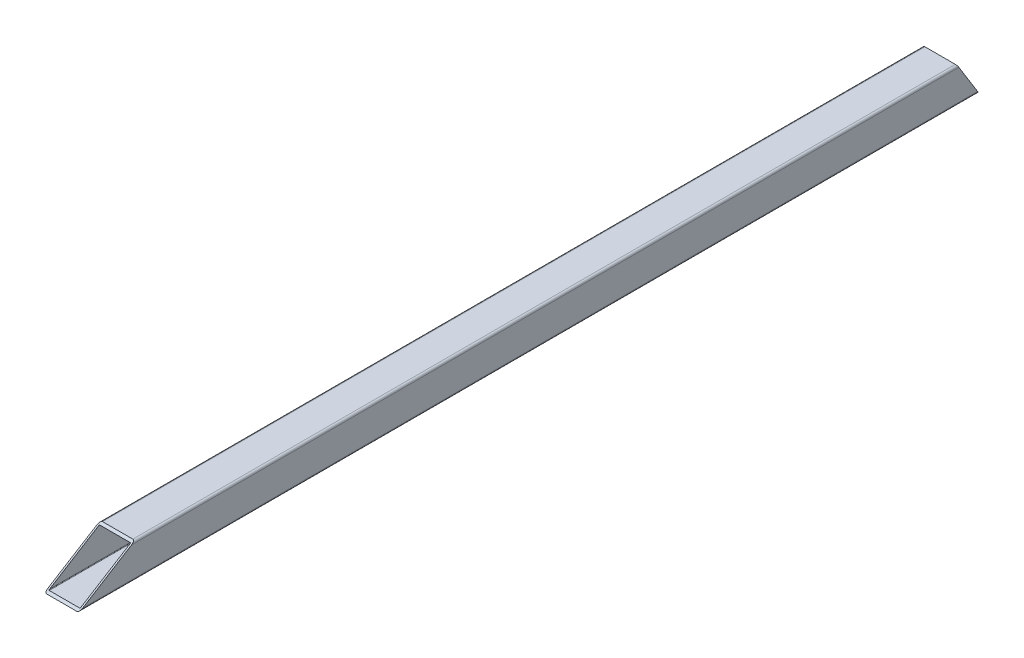
ISO-10303-21;
HEADER;
FILE_DESCRIPTION(('STEP AP214'),'2;1');
FILE_NAME('part.step','',(''),(''),'','','');
FILE_SCHEMA(('AUTOMOTIVE_DESIGN { 1 0 10303 214 1 1 1 1 }'));
ENDSEC;
DATA;
#1=APPLICATION_CONTEXT('core data for automotive mechanical design processes');
#2=APPLICATION_PROTOCOL_DEFINITION('international standard','automotive_design',2000,#1);
#3=PRODUCT_CONTEXT('',#1,'mechanical');
#4=PRODUCT('Part','Part','',(#3));
#5=PRODUCT_RELATED_PRODUCT_CATEGORY('part','',(#4));
#6=PRODUCT_DEFINITION_FORMATION('','',#4);
#7=PRODUCT_DEFINITION_CONTEXT('part definition',#1,'design');
#8=PRODUCT_DEFINITION('design','',#6,#7);
#9=PRODUCT_DEFINITION_SHAPE('','',#8);
#10=(LENGTH_UNIT() NAMED_UNIT(*) SI_UNIT(.MILLI.,.METRE.));
#11=(NAMED_UNIT(*) PLANE_ANGLE_UNIT() SI_UNIT($,.RADIAN.));
#12=(NAMED_UNIT(*) SI_UNIT($,.STERADIAN.) SOLID_ANGLE_UNIT());
#13=UNCERTAINTY_MEASURE_WITH_UNIT(LENGTH_MEASURE(1.E-05),#10,'distance_accuracy_value','');
#14=(GEOMETRIC_REPRESENTATION_CONTEXT(3) GLOBAL_UNCERTAINTY_ASSIGNED_CONTEXT((#13)) GLOBAL_UNIT_ASSIGNED_CONTEXT((#10,
#11,#12)) REPRESENTATION_CONTEXT('',''));
#15=CARTESIAN_POINT('',(0.,0.,0.));
#16=DIRECTION('',(0.,0.,1.));
#17=DIRECTION('',(1.,0.,0.));
#18=AXIS2_PLACEMENT_3D('',#15,#16,#17);
#19=CARTESIAN_POINT('',(14.,-14.,-415.2));
#20=DIRECTION('',(0.,0.,1.));
#21=DIRECTION('',(1.,0.,0.));
#22=AXIS2_PLACEMENT_3D('',#19,#20,#21);
#23=CYLINDRICAL_SURFACE('',#22,2.);
#24=CARTESIAN_POINT('',(14.,-14.,-413.959464151528));
#25=DIRECTION('',(0.,-0.527104121727736,0.849800708906289));
#26=DIRECTION('',(0.,0.849800708906289,0.527104121727736));
#27=AXIS2_PLACEMENT_3D('',#24,#25,#26);
#28=ELLIPSE('',#27,2.35349297669337,2.);
#29=CARTESIAN_POINT('',(16.,-14.,-413.959464151528));
#30=VERTEX_POINT('',#29);
#31=CARTESIAN_POINT('',(14.,-16.,-415.2));
#32=VERTEX_POINT('',#31);
#33=EDGE_CURVE('E246',#30,#32,#28,.F.);
#34=ORIENTED_EDGE('',*,*,#33,.F.);
#35=DIRECTION('',(0.,0.,1.));
#36=VECTOR('',#35,1.);
#37=CARTESIAN_POINT('',(16.,-14.,-415.2));
#38=LINE('',#37,#36);
#39=CARTESIAN_POINT('',(16.,-14.,411.975586932916));
#40=VERTEX_POINT('',#39);
#41=EDGE_CURVE('E166',#30,#40,#38,.T.);
#42=ORIENTED_EDGE('',*,*,#41,.T.);
#43=CARTESIAN_POINT('',(14.,-14.,411.975586932916));
#44=DIRECTION('',(0.,-0.849800708906287,-0.527104121727739));
#45=DIRECTION('',(0.,-0.527104121727739,0.849800708906287));
#46=AXIS2_PLACEMENT_3D('',#43,#44,#45);
#47=ELLIPSE('',#46,3.79431675366986,2.);
#48=CARTESIAN_POINT('',(14.,-16.,415.2));
#49=VERTEX_POINT('',#48);
#50=EDGE_CURVE('E208',#49,#40,#47,.F.);
#51=ORIENTED_EDGE('',*,*,#50,.F.);
#52=DIRECTION('',(0.,0.,1.));
#53=VECTOR('',#52,1.);
#54=CARTESIAN_POINT('',(14.,-16.,-415.2));
#55=LINE('',#54,#53);
#56=EDGE_CURVE('E43',#32,#49,#55,.T.);
#57=ORIENTED_EDGE('',*,*,#56,.F.);
#58=EDGE_LOOP('',(#34,#42,#51,#57));
#59=FACE_BOUND('',#58,.T.);
#60=ADVANCED_FACE('F36',(#59),#23,.T.);
#61=CARTESIAN_POINT('',(-14.,-16.,-415.2));
#62=DIRECTION('',(0.,-1.,0.));
#63=DIRECTION('',(0.,0.,-1.));
#64=AXIS2_PLACEMENT_3D('',#61,#62,#63);
#65=PLANE('',#64);
#66=ORIENTED_EDGE('',*,*,#56,.T.);
#67=DIRECTION('',(1.,0.,0.));
#68=VECTOR('',#67,1.);
#69=CARTESIAN_POINT('',(-14.,-16.,415.2));
#70=LINE('',#69,#68);
#71=CARTESIAN_POINT('',(-14.,-16.,415.2));
#72=VERTEX_POINT('',#71);
#73=EDGE_CURVE('E194',#72,#49,#70,.T.);
#74=ORIENTED_EDGE('',*,*,#73,.F.);
#75=DIRECTION('',(0.,0.,1.));
#76=VECTOR('',#75,1.);
#77=CARTESIAN_POINT('',(-14.,-16.,-415.2));
#78=LINE('',#77,#76);
#79=CARTESIAN_POINT('',(-14.,-16.,-415.2));
#80=VERTEX_POINT('',#79);
#81=EDGE_CURVE('E184',#80,#72,#78,.T.);
#82=ORIENTED_EDGE('',*,*,#81,.F.);
#83=DIRECTION('',(1.,0.,0.));
#84=VECTOR('',#83,1.);
#85=CARTESIAN_POINT('',(-14.,-16.,-415.2));
#86=LINE('',#85,#84);
#87=EDGE_CURVE('E177',#80,#32,#86,.T.);
#88=ORIENTED_EDGE('',*,*,#87,.T.);
#89=EDGE_LOOP('',(#66,#74,#82,#88));
#90=FACE_BOUND('',#89,.T.);
#91=ADVANCED_FACE('F299',(#90),#65,.T.);
#92=CARTESIAN_POINT('',(-14.,-14.,-415.2));
#93=DIRECTION('',(0.,0.,1.));
#94=DIRECTION('',(1.,0.,0.));
#95=AXIS2_PLACEMENT_3D('',#92,#93,#94);
#96=CYLINDRICAL_SURFACE('',#95,2.);
#97=CARTESIAN_POINT('',(-14.,-14.,-413.959464151528));
#98=DIRECTION('',(0.,-0.527104121727736,0.849800708906289));
#99=DIRECTION('',(0.,0.849800708906289,0.527104121727736));
#100=AXIS2_PLACEMENT_3D('',#97,#98,#99);
#101=ELLIPSE('',#100,2.35349297669337,2.);
#102=CARTESIAN_POINT('',(-16.,-14.,-413.959464151528));
#103=VERTEX_POINT('',#102);
#104=EDGE_CURVE('E250',#80,#103,#101,.F.);
#105=ORIENTED_EDGE('',*,*,#104,.F.);
#106=ORIENTED_EDGE('',*,*,#81,.T.);
#107=CARTESIAN_POINT('',(-14.,-14.,411.975586932916));
#108=DIRECTION('',(0.,-0.849800708906287,-0.527104121727739));
#109=DIRECTION('',(0.,-0.527104121727739,0.849800708906287));
#110=AXIS2_PLACEMENT_3D('',#107,#108,#109);
#111=ELLIPSE('',#110,3.79431675366986,2.);
#112=CARTESIAN_POINT('',(-16.,-14.,411.975586932916));
#113=VERTEX_POINT('',#112);
#114=EDGE_CURVE('E211',#113,#72,#111,.F.);
#115=ORIENTED_EDGE('',*,*,#114,.F.);
#116=DIRECTION('',(0.,0.,1.));
#117=VECTOR('',#116,1.);
#118=CARTESIAN_POINT('',(-16.,-14.,-415.2));
#119=LINE('',#118,#117);
#120=EDGE_CURVE('E182',#103,#113,#119,.T.);
#121=ORIENTED_EDGE('',*,*,#120,.F.);
#122=EDGE_LOOP('',(#105,#106,#115,#121));
#123=FACE_BOUND('',#122,.T.);
#124=ADVANCED_FACE('F282',(#123),#96,.T.);
#125=CARTESIAN_POINT('',(-16.,-14.,-415.2));
#126=DIRECTION('',(-1.,0.,0.));
#127=DIRECTION('',(0.,0.,1.));
#128=AXIS2_PLACEMENT_3D('',#125,#126,#127);
#129=PLANE('',#128);
#130=DIRECTION('',(0.,-0.849800708906289,-0.527104121727736));
#131=VECTOR('',#130,1.);
#132=CARTESIAN_POINT('',(-16.,-16.,-415.2));
#133=LINE('',#132,#131);
#134=CARTESIAN_POINT('',(-16.,14.,-396.591962272915));
#135=VERTEX_POINT('',#134);
#136=EDGE_CURVE('E167',#135,#103,#133,.T.);
#137=ORIENTED_EDGE('',*,*,#136,.T.);
#138=ORIENTED_EDGE('',*,*,#120,.T.);
#139=DIRECTION('',(0.,0.527104121727739,-0.849800708906287));
#140=VECTOR('',#139,1.);
#141=CARTESIAN_POINT('',(-16.,-16.,415.2));
#142=LINE('',#141,#140);
#143=CARTESIAN_POINT('',(-16.,14.0000000000001,366.833803993745));
#144=VERTEX_POINT('',#143);
#145=EDGE_CURVE('E243',#113,#144,#142,.T.);
#146=ORIENTED_EDGE('',*,*,#145,.T.);
#147=DIRECTION('',(0.,0.,1.));
#148=VECTOR('',#147,1.);
#149=CARTESIAN_POINT('',(-16.,14.,-415.2));
#150=LINE('',#149,#148);
#151=EDGE_CURVE('E180',#135,#144,#150,.T.);
#152=ORIENTED_EDGE('',*,*,#151,.F.);
#153=EDGE_LOOP('',(#137,#138,#146,#152));
#154=FACE_BOUND('',#153,.T.);
#155=ADVANCED_FACE('F276',(#154),#129,.T.);
#156=CARTESIAN_POINT('',(-14.,14.,-415.2));
#157=DIRECTION('',(0.,0.,1.));
#158=DIRECTION('',(1.,0.,0.));
#159=AXIS2_PLACEMENT_3D('',#156,#157,#158);
#160=CYLINDRICAL_SURFACE('',#159,2.);
#161=CARTESIAN_POINT('',(-14.,14.,-396.591962272915));
#162=DIRECTION('',(0.,-0.527104121727736,0.849800708906289));
#163=DIRECTION('',(0.,0.849800708906289,0.527104121727736));
#164=AXIS2_PLACEMENT_3D('',#161,#162,#163);
#165=ELLIPSE('',#164,2.35349297669337,2.);
#166=CARTESIAN_POINT('',(-14.,16.,-395.351426424442));
#167=VERTEX_POINT('',#166);
#168=EDGE_CURVE('E158',#135,#167,#165,.F.);
#169=ORIENTED_EDGE('',*,*,#168,.F.);
#170=ORIENTED_EDGE('',*,*,#151,.T.);
#171=CARTESIAN_POINT('',(-14.,14.,366.833803993745));
#172=DIRECTION('',(0.,-0.849800708906287,-0.527104121727739));
#173=DIRECTION('',(0.,-0.527104121727739,0.849800708906287));
#174=AXIS2_PLACEMENT_3D('',#171,#172,#173);
#175=ELLIPSE('',#174,3.79431675366986,2.);
#176=CARTESIAN_POINT('',(-14.,16.,363.609390926662));
#177=VERTEX_POINT('',#176);
#178=EDGE_CURVE('E213',#177,#144,#175,.F.);
#179=ORIENTED_EDGE('',*,*,#178,.F.);
#180=DIRECTION('',(0.,0.,1.));
#181=VECTOR('',#180,1.);
#182=CARTESIAN_POINT('',(-14.,16.,-415.2));
#183=LINE('',#182,#181);
#184=EDGE_CURVE('E175',#167,#177,#183,.T.);
#185=ORIENTED_EDGE('',*,*,#184,.F.);
#186=EDGE_LOOP('',(#169,#170,#179,#185));
#187=FACE_BOUND('',#186,.T.);
#188=ADVANCED_FACE('F293',(#187),#160,.T.);
#189=CARTESIAN_POINT('',(-14.,16.,-415.2));
#190=DIRECTION('',(0.,1.,0.));
#191=DIRECTION('',(0.,0.,1.));
#192=AXIS2_PLACEMENT_3D('',#189,#190,#191);
#193=PLANE('',#192);
#194=DIRECTION('',(1.,0.,0.));
#195=VECTOR('',#194,1.);
#196=CARTESIAN_POINT('',(-16.,16.,-395.351426424442));
#197=LINE('',#196,#195);
#198=CARTESIAN_POINT('',(14.,16.,-395.351426424442));
#199=VERTEX_POINT('',#198);
#200=EDGE_CURVE('E154',#167,#199,#197,.T.);
#201=ORIENTED_EDGE('',*,*,#200,.F.);
#202=ORIENTED_EDGE('',*,*,#184,.T.);
#203=DIRECTION('',(1.,0.,0.));
#204=VECTOR('',#203,1.);
#205=CARTESIAN_POINT('',(-16.,16.,363.609390926662));
#206=LINE('',#205,#204);
#207=CARTESIAN_POINT('',(14.,16.,363.609390926662));
#208=VERTEX_POINT('',#207);
#209=EDGE_CURVE('E240',#177,#208,#206,.T.);
#210=ORIENTED_EDGE('',*,*,#209,.T.);
#211=DIRECTION('',(0.,0.,1.));
#212=VECTOR('',#211,1.);
#213=CARTESIAN_POINT('',(14.,16.,-415.2));
#214=LINE('',#213,#212);
#215=EDGE_CURVE('E173',#199,#208,#214,.T.);
#216=ORIENTED_EDGE('',*,*,#215,.F.);
#217=EDGE_LOOP('',(#201,#202,#210,#216));
#218=FACE_BOUND('',#217,.T.);
#219=ADVANCED_FACE('F295',(#218),#193,.T.);
#220=CARTESIAN_POINT('',(14.,14.,-415.2));
#221=DIRECTION('',(0.,0.,1.));
#222=DIRECTION('',(1.,0.,0.));
#223=AXIS2_PLACEMENT_3D('',#220,#221,#222);
#224=CYLINDRICAL_SURFACE('',#223,2.);
#225=CARTESIAN_POINT('',(14.,14.,-396.591962272915));
#226=DIRECTION('',(0.,-0.527104121727736,0.849800708906289));
#227=DIRECTION('',(0.,0.849800708906289,0.527104121727736));
#228=AXIS2_PLACEMENT_3D('',#225,#226,#227);
#229=ELLIPSE('',#228,2.35349297669337,2.);
#230=CARTESIAN_POINT('',(16.,14.,-396.591962272915));
#231=VERTEX_POINT('',#230);
#232=EDGE_CURVE('E148',#199,#231,#229,.F.);
#233=ORIENTED_EDGE('',*,*,#232,.F.);
#234=ORIENTED_EDGE('',*,*,#215,.T.);
#235=CARTESIAN_POINT('',(14.,14.,366.833803993745));
#236=DIRECTION('',(0.,-0.849800708906287,-0.527104121727739));
#237=DIRECTION('',(0.,-0.527104121727739,0.849800708906287));
#238=AXIS2_PLACEMENT_3D('',#235,#236,#237);
#239=ELLIPSE('',#238,3.79431675366986,2.);
#240=CARTESIAN_POINT('',(16.,14.,366.833803993745));
#241=VERTEX_POINT('',#240);
#242=EDGE_CURVE('E172',#241,#208,#239,.F.);
#243=ORIENTED_EDGE('',*,*,#242,.F.);
#244=DIRECTION('',(0.,0.,1.));
#245=VECTOR('',#244,1.);
#246=CARTESIAN_POINT('',(16.,14.,-415.2));
#247=LINE('',#246,#245);
#248=EDGE_CURVE('E164',#231,#241,#247,.T.);
#249=ORIENTED_EDGE('',*,*,#248,.F.);
#250=EDGE_LOOP('',(#233,#234,#243,#249));
#251=FACE_BOUND('',#250,.T.);
#252=ADVANCED_FACE('F170',(#251),#224,.T.);
#253=CARTESIAN_POINT('',(16.,-14.,-415.2));
#254=DIRECTION('',(1.,0.,0.));
#255=DIRECTION('',(0.,0.,-1.));
#256=AXIS2_PLACEMENT_3D('',#253,#254,#255);
#257=PLANE('',#256);
#258=DIRECTION('',(0.,-0.849800708906289,-0.527104121727736));
#259=VECTOR('',#258,1.);
#260=CARTESIAN_POINT('',(16.,-16.,-415.2));
#261=LINE('',#260,#259);
#262=EDGE_CURVE('E151',#231,#30,#261,.T.);
#263=ORIENTED_EDGE('',*,*,#262,.F.);
#264=ORIENTED_EDGE('',*,*,#248,.T.);
#265=DIRECTION('',(0.,0.527104121727739,-0.849800708906287));
#266=VECTOR('',#265,1.);
#267=CARTESIAN_POINT('',(16.,-16.,415.2));
#268=LINE('',#267,#266);
#269=EDGE_CURVE('E244',#40,#241,#268,.T.);
#270=ORIENTED_EDGE('',*,*,#269,.F.);
#271=ORIENTED_EDGE('',*,*,#41,.F.);
#272=EDGE_LOOP('',(#263,#264,#270,#271));
#273=FACE_BOUND('',#272,.T.);
#274=ADVANCED_FACE('F162',(#273),#257,.T.);
#275=CARTESIAN_POINT('',(-14.,14.,-415.2));
#276=DIRECTION('',(0.,0.,1.));
#277=DIRECTION('',(1.,0.,0.));
#278=AXIS2_PLACEMENT_3D('',#275,#276,#277);
#279=CYLINDRICAL_SURFACE('',#278,0.48);
#280=DIRECTION('',(0.,0.,1.));
#281=VECTOR('',#280,1.);
#282=CARTESIAN_POINT('',(-14.48,14.,-415.2));
#283=LINE('',#282,#281);
#284=CARTESIAN_POINT('',(-14.48,14.,-396.591962272915));
#285=VERTEX_POINT('',#284);
#286=CARTESIAN_POINT('',(-14.48,14.,366.833803993745));
#287=VERTEX_POINT('',#286);
#288=EDGE_CURVE('E192',#285,#287,#283,.T.);
#289=ORIENTED_EDGE('',*,*,#288,.F.);
#290=CARTESIAN_POINT('',(-14.,14.,-396.591962272915));
#291=DIRECTION('',(0.,-0.527104121727736,0.849800708906289));
#292=DIRECTION('',(0.,0.849800708906289,0.527104121727736));
#293=AXIS2_PLACEMENT_3D('',#290,#291,#292);
#294=ELLIPSE('',#293,0.564838314406409,0.48);
#295=CARTESIAN_POINT('',(-14.,14.48,-396.294233669281));
#296=VERTEX_POINT('',#295);
#297=EDGE_CURVE('E50',#285,#296,#294,.F.);
#298=ORIENTED_EDGE('',*,*,#297,.T.);
#299=DIRECTION('',(0.,0.,1.));
#300=VECTOR('',#299,1.);
#301=CARTESIAN_POINT('',(-14.,14.48,-415.2));
#302=LINE('',#301,#300);
#303=CARTESIAN_POINT('',(-14.,14.48,366.059944857645));
#304=VERTEX_POINT('',#303);
#305=EDGE_CURVE('E191',#296,#304,#302,.T.);
#306=ORIENTED_EDGE('',*,*,#305,.T.);
#307=CARTESIAN_POINT('',(-14.,14.,366.833803993745));
#308=DIRECTION('',(0.,-0.849800708906287,-0.527104121727739));
#309=DIRECTION('',(0.,-0.527104121727739,0.849800708906287));
#310=AXIS2_PLACEMENT_3D('',#307,#308,#309);
#311=ELLIPSE('',#310,0.910636020880766,0.48);
#312=EDGE_CURVE('E217',#304,#287,#311,.F.);
#313=ORIENTED_EDGE('',*,*,#312,.T.);
#314=EDGE_LOOP('',(#289,#298,#306,#313));
#315=FACE_BOUND('',#314,.T.);
#316=ADVANCED_FACE('F308',(#315),#279,.F.);
#317=CARTESIAN_POINT('',(-14.,14.48,-415.2));
#318=DIRECTION('',(0.,1.,0.));
#319=DIRECTION('',(0.,0.,1.));
#320=AXIS2_PLACEMENT_3D('',#317,#318,#319);
#321=PLANE('',#320);
#322=ORIENTED_EDGE('',*,*,#305,.F.);
#323=DIRECTION('',(1.,0.,0.));
#324=VECTOR('',#323,1.);
#325=CARTESIAN_POINT('',(-14.,14.48,-396.294233669281));
#326=LINE('',#325,#324);
#327=CARTESIAN_POINT('',(14.,14.48,-396.294233669281));
#328=VERTEX_POINT('',#327);
#329=EDGE_CURVE('E254',#296,#328,#326,.T.);
#330=ORIENTED_EDGE('',*,*,#329,.T.);
#331=DIRECTION('',(0.,0.,1.));
#332=VECTOR('',#331,1.);
#333=CARTESIAN_POINT('',(14.,14.48,-415.2));
#334=LINE('',#333,#332);
#335=CARTESIAN_POINT('',(14.,14.48,366.059944857645));
#336=VERTEX_POINT('',#335);
#337=EDGE_CURVE('E204',#328,#336,#334,.T.);
#338=ORIENTED_EDGE('',*,*,#337,.T.);
#339=DIRECTION('',(-1.,0.,0.));
#340=VECTOR('',#339,1.);
#341=CARTESIAN_POINT('',(-14.,14.48,366.059944857645));
#342=LINE('',#341,#340);
#343=EDGE_CURVE('E220',#336,#304,#342,.T.);
#344=ORIENTED_EDGE('',*,*,#343,.T.);
#345=EDGE_LOOP('',(#322,#330,#338,#344));
#346=FACE_BOUND('',#345,.T.);
#347=ADVANCED_FACE('F322',(#346),#321,.F.);
#348=CARTESIAN_POINT('',(14.,14.,-415.2));
#349=DIRECTION('',(0.,0.,1.));
#350=DIRECTION('',(1.,0.,0.));
#351=AXIS2_PLACEMENT_3D('',#348,#349,#350);
#352=CYLINDRICAL_SURFACE('',#351,0.48);
#353=ORIENTED_EDGE('',*,*,#337,.F.);
#354=CARTESIAN_POINT('',(14.,14.,-396.591962272915));
#355=DIRECTION('',(0.,-0.527104121727736,0.849800708906289));
#356=DIRECTION('',(0.,0.849800708906289,0.527104121727736));
#357=AXIS2_PLACEMENT_3D('',#354,#355,#356);
#358=ELLIPSE('',#357,0.564838314406409,0.48);
#359=CARTESIAN_POINT('',(14.48,14.,-396.591962272915));
#360=VERTEX_POINT('',#359);
#361=EDGE_CURVE('E257',#328,#360,#358,.F.);
#362=ORIENTED_EDGE('',*,*,#361,.T.);
#363=DIRECTION('',(0.,0.,1.));
#364=VECTOR('',#363,1.);
#365=CARTESIAN_POINT('',(14.48,14.,-415.2));
#366=LINE('',#365,#364);
#367=CARTESIAN_POINT('',(14.48,14.,366.833803993745));
#368=VERTEX_POINT('',#367);
#369=EDGE_CURVE('E202',#360,#368,#366,.T.);
#370=ORIENTED_EDGE('',*,*,#369,.T.);
#371=CARTESIAN_POINT('',(14.,14.,366.833803993745));
#372=DIRECTION('',(0.,-0.849800708906287,-0.527104121727739));
#373=DIRECTION('',(0.,-0.527104121727739,0.849800708906287));
#374=AXIS2_PLACEMENT_3D('',#371,#372,#373);
#375=ELLIPSE('',#374,0.910636020880766,0.48);
#376=EDGE_CURVE('E223',#368,#336,#375,.F.);
#377=ORIENTED_EDGE('',*,*,#376,.T.);
#378=EDGE_LOOP('',(#353,#362,#370,#377));
#379=FACE_BOUND('',#378,.T.);
#380=ADVANCED_FACE('F327',(#379),#352,.F.);
#381=CARTESIAN_POINT('',(14.48,-14.,-415.2));
#382=DIRECTION('',(1.,0.,0.));
#383=DIRECTION('',(0.,0.,-1.));
#384=AXIS2_PLACEMENT_3D('',#381,#382,#383);
#385=PLANE('',#384);
#386=ORIENTED_EDGE('',*,*,#369,.F.);
#387=DIRECTION('',(0.,-0.849800708906289,-0.527104121727736));
#388=VECTOR('',#387,1.);
#389=CARTESIAN_POINT('',(14.48,-14.5556775102847,-414.304133087377));
#390=LINE('',#389,#388);
#391=CARTESIAN_POINT('',(14.48,-14.,-413.959464151528));
#392=VERTEX_POINT('',#391);
#393=EDGE_CURVE('E260',#360,#392,#390,.T.);
#394=ORIENTED_EDGE('',*,*,#393,.T.);
#395=DIRECTION('',(0.,0.,1.));
#396=VECTOR('',#395,1.);
#397=CARTESIAN_POINT('',(14.48,-14.,-415.2));
#398=LINE('',#397,#396);
#399=CARTESIAN_POINT('',(14.48,-14.,411.975586932916));
#400=VERTEX_POINT('',#399);
#401=EDGE_CURVE('E200',#392,#400,#398,.T.);
#402=ORIENTED_EDGE('',*,*,#401,.T.);
#403=DIRECTION('',(0.,0.527104121727739,-0.849800708906288));
#404=VECTOR('',#403,1.);
#405=CARTESIAN_POINT('',(14.48,356.519619631486,-185.378564642398));
#406=LINE('',#405,#404);
#407=EDGE_CURVE('E226',#400,#368,#406,.T.);
#408=ORIENTED_EDGE('',*,*,#407,.T.);
#409=EDGE_LOOP('',(#386,#394,#402,#408));
#410=FACE_BOUND('',#409,.T.);
#411=ADVANCED_FACE('F350',(#410),#385,.F.);
#412=CARTESIAN_POINT('',(14.,-14.,-415.2));
#413=DIRECTION('',(0.,0.,1.));
#414=DIRECTION('',(1.,0.,0.));
#415=AXIS2_PLACEMENT_3D('',#412,#413,#414);
#416=CYLINDRICAL_SURFACE('',#415,0.48);
#417=ORIENTED_EDGE('',*,*,#401,.F.);
#418=CARTESIAN_POINT('',(14.,-14.,-413.959464151528));
#419=DIRECTION('',(0.,-0.527104121727736,0.849800708906289));
#420=DIRECTION('',(0.,0.849800708906289,0.527104121727736));
#421=AXIS2_PLACEMENT_3D('',#418,#419,#420);
#422=ELLIPSE('',#421,0.564838314406409,0.48);
#423=CARTESIAN_POINT('',(14.,-14.48,-414.257192755161));
#424=VERTEX_POINT('',#423);
#425=EDGE_CURVE('E263',#392,#424,#422,.F.);
#426=ORIENTED_EDGE('',*,*,#425,.T.);
#427=DIRECTION('',(0.,0.,1.));
#428=VECTOR('',#427,1.);
#429=CARTESIAN_POINT('',(14.,-14.48,-415.2));
#430=LINE('',#429,#428);
#431=CARTESIAN_POINT('',(14.,-14.48,412.749446069017));
#432=VERTEX_POINT('',#431);
#433=EDGE_CURVE('E198',#424,#432,#430,.T.);
#434=ORIENTED_EDGE('',*,*,#433,.T.);
#435=CARTESIAN_POINT('',(14.,-14.,411.975586932916));
#436=DIRECTION('',(0.,-0.849800708906287,-0.527104121727739));
#437=DIRECTION('',(0.,-0.527104121727739,0.849800708906287));
#438=AXIS2_PLACEMENT_3D('',#435,#436,#437);
#439=ELLIPSE('',#438,0.910636020880766,0.48);
#440=EDGE_CURVE('E229',#432,#400,#439,.F.);
#441=ORIENTED_EDGE('',*,*,#440,.T.);
#442=EDGE_LOOP('',(#417,#426,#434,#441));
#443=FACE_BOUND('',#442,.T.);
#444=ADVANCED_FACE('F346',(#443),#416,.F.);
#445=CARTESIAN_POINT('',(-14.,-14.48,-415.2));
#446=DIRECTION('',(0.,-1.,0.));
#447=DIRECTION('',(0.,0.,-1.));
#448=AXIS2_PLACEMENT_3D('',#445,#446,#447);
#449=PLANE('',#448);
#450=ORIENTED_EDGE('',*,*,#433,.F.);
#451=DIRECTION('',(-1.,0.,0.));
#452=VECTOR('',#451,1.);
#453=CARTESIAN_POINT('',(-14.,-14.48,-414.257192755161));
#454=LINE('',#453,#452);
#455=CARTESIAN_POINT('',(-14.,-14.48,-414.257192755161));
#456=VERTEX_POINT('',#455);
#457=EDGE_CURVE('E266',#424,#456,#454,.T.);
#458=ORIENTED_EDGE('',*,*,#457,.T.);
#459=DIRECTION('',(0.,0.,1.));
#460=VECTOR('',#459,1.);
#461=CARTESIAN_POINT('',(-14.,-14.48,-415.2));
#462=LINE('',#461,#460);
#463=CARTESIAN_POINT('',(-14.,-14.48,412.749446069017));
#464=VERTEX_POINT('',#463);
#465=EDGE_CURVE('E196',#456,#464,#462,.T.);
#466=ORIENTED_EDGE('',*,*,#465,.T.);
#467=DIRECTION('',(1.,0.,0.));
#468=VECTOR('',#467,1.);
#469=CARTESIAN_POINT('',(-14.,-14.48,412.749446069017));
#470=LINE('',#469,#468);
#471=EDGE_CURVE('E232',#464,#432,#470,.T.);
#472=ORIENTED_EDGE('',*,*,#471,.T.);
#473=EDGE_LOOP('',(#450,#458,#466,#472));
#474=FACE_BOUND('',#473,.T.);
#475=ADVANCED_FACE('F343',(#474),#449,.F.);
#476=CARTESIAN_POINT('',(-14.,-14.,-415.2));
#477=DIRECTION('',(0.,0.,1.));
#478=DIRECTION('',(1.,0.,0.));
#479=AXIS2_PLACEMENT_3D('',#476,#477,#478);
#480=CYLINDRICAL_SURFACE('',#479,0.48);
#481=ORIENTED_EDGE('',*,*,#465,.F.);
#482=CARTESIAN_POINT('',(-14.,-14.,-413.959464151528));
#483=DIRECTION('',(0.,-0.527104121727736,0.849800708906289));
#484=DIRECTION('',(0.,0.849800708906289,0.527104121727736));
#485=AXIS2_PLACEMENT_3D('',#482,#483,#484);
#486=ELLIPSE('',#485,0.564838314406409,0.48);
#487=CARTESIAN_POINT('',(-14.48,-14.,-413.959464151528));
#488=VERTEX_POINT('',#487);
#489=EDGE_CURVE('E269',#456,#488,#486,.F.);
#490=ORIENTED_EDGE('',*,*,#489,.T.);
#491=DIRECTION('',(0.,0.,1.));
#492=VECTOR('',#491,1.);
#493=CARTESIAN_POINT('',(-14.48,-14.,-415.2));
#494=LINE('',#493,#492);
#495=CARTESIAN_POINT('',(-14.48,-14.0000000000001,411.975586932917));
#496=VERTEX_POINT('',#495);
#497=EDGE_CURVE('E57',#488,#496,#494,.T.);
#498=ORIENTED_EDGE('',*,*,#497,.T.);
#499=CARTESIAN_POINT('',(-14.,-14.,411.975586932916));
#500=DIRECTION('',(0.,-0.849800708906287,-0.527104121727739));
#501=DIRECTION('',(0.,-0.527104121727739,0.849800708906287));
#502=AXIS2_PLACEMENT_3D('',#499,#500,#501);
#503=ELLIPSE('',#502,0.910636020880766,0.48);
#504=EDGE_CURVE('E235',#496,#464,#503,.F.);
#505=ORIENTED_EDGE('',*,*,#504,.T.);
#506=EDGE_LOOP('',(#481,#490,#498,#505));
#507=FACE_BOUND('',#506,.T.);
#508=ADVANCED_FACE('F340',(#507),#480,.F.);
#509=CARTESIAN_POINT('',(-14.48,-14.,-415.2));
#510=DIRECTION('',(-1.,0.,0.));
#511=DIRECTION('',(0.,0.,1.));
#512=AXIS2_PLACEMENT_3D('',#509,#510,#511);
#513=PLANE('',#512);
#514=ORIENTED_EDGE('',*,*,#497,.F.);
#515=DIRECTION('',(0.,0.849800708906289,0.527104121727736));
#516=VECTOR('',#515,1.);
#517=CARTESIAN_POINT('',(-14.48,-14.5556775102847,-414.304133087377));
#518=LINE('',#517,#516);
#519=EDGE_CURVE('E11',#488,#285,#518,.T.);
#520=ORIENTED_EDGE('',*,*,#519,.T.);
#521=ORIENTED_EDGE('',*,*,#288,.T.);
#522=DIRECTION('',(0.,-0.527104121727739,0.849800708906288));
#523=VECTOR('',#522,1.);
#524=CARTESIAN_POINT('',(-14.48,356.519619631486,-185.378564642398));
#525=LINE('',#524,#523);
#526=EDGE_CURVE('E237',#287,#496,#525,.T.);
#527=ORIENTED_EDGE('',*,*,#526,.T.);
#528=EDGE_LOOP('',(#514,#520,#521,#527));
#529=FACE_BOUND('',#528,.T.);
#530=ADVANCED_FACE('F335',(#529),#513,.F.);
#531=CARTESIAN_POINT('',(-16.,-16.,415.2));
#532=DIRECTION('',(0.,-0.849800708906287,-0.527104121727739));
#533=DIRECTION('',(0.,0.527104121727739,-0.849800708906287));
#534=AXIS2_PLACEMENT_3D('',#531,#532,#533);
#535=PLANE('',#534);
#536=ORIENTED_EDGE('',*,*,#50,.T.);
#537=ORIENTED_EDGE('',*,*,#269,.T.);
#538=ORIENTED_EDGE('',*,*,#242,.T.);
#539=ORIENTED_EDGE('',*,*,#209,.F.);
#540=ORIENTED_EDGE('',*,*,#178,.T.);
#541=ORIENTED_EDGE('',*,*,#145,.F.);
#542=ORIENTED_EDGE('',*,*,#114,.T.);
#543=ORIENTED_EDGE('',*,*,#73,.T.);
#544=EDGE_LOOP('',(#536,#537,#538,#539,#540,#541,#542,#543));
#545=FACE_BOUND('',#544,.T.);
#546=ORIENTED_EDGE('',*,*,#343,.F.);
#547=ORIENTED_EDGE('',*,*,#376,.F.);
#548=ORIENTED_EDGE('',*,*,#407,.F.);
#549=ORIENTED_EDGE('',*,*,#440,.F.);
#550=ORIENTED_EDGE('',*,*,#471,.F.);
#551=ORIENTED_EDGE('',*,*,#504,.F.);
#552=ORIENTED_EDGE('',*,*,#526,.F.);
#553=ORIENTED_EDGE('',*,*,#312,.F.);
#554=EDGE_LOOP('',(#546,#547,#548,#549,#550,#551,#552,#553));
#555=FACE_BOUND('',#554,.T.);
#556=ADVANCED_FACE('F286',(#545,#555),#535,.F.);
#557=CARTESIAN_POINT('',(-16.,-16.,-415.2));
#558=DIRECTION('',(0.,-0.527104121727736,0.849800708906289));
#559=DIRECTION('',(0.,-0.849800708906289,-0.527104121727736));
#560=AXIS2_PLACEMENT_3D('',#557,#558,#559);
#561=PLANE('',#560);
#562=ORIENTED_EDGE('',*,*,#33,.T.);
#563=ORIENTED_EDGE('',*,*,#87,.F.);
#564=ORIENTED_EDGE('',*,*,#104,.T.);
#565=ORIENTED_EDGE('',*,*,#136,.F.);
#566=ORIENTED_EDGE('',*,*,#168,.T.);
#567=ORIENTED_EDGE('',*,*,#200,.T.);
#568=ORIENTED_EDGE('',*,*,#232,.T.);
#569=ORIENTED_EDGE('',*,*,#262,.T.);
#570=EDGE_LOOP('',(#562,#563,#564,#565,#566,#567,#568,#569));
#571=FACE_BOUND('',#570,.T.);
#572=ORIENTED_EDGE('',*,*,#519,.F.);
#573=ORIENTED_EDGE('',*,*,#489,.F.);
#574=ORIENTED_EDGE('',*,*,#457,.F.);
#575=ORIENTED_EDGE('',*,*,#425,.F.);
#576=ORIENTED_EDGE('',*,*,#393,.F.);
#577=ORIENTED_EDGE('',*,*,#361,.F.);
#578=ORIENTED_EDGE('',*,*,#329,.F.);
#579=ORIENTED_EDGE('',*,*,#297,.F.);
#580=EDGE_LOOP('',(#572,#573,#574,#575,#576,#577,#578,#579));
#581=FACE_BOUND('',#580,.T.);
#582=ADVANCED_FACE('F150',(#571,#581),#561,.F.);
#583=CLOSED_SHELL('',(#60,#91,#124,#155,#188,#219,#252,#274,#316,#347,#380,#411,#444,#475,#508,
#530,#556,#582));
#584=MANIFOLD_SOLID_BREP('B2',#583);
#585=ADVANCED_BREP_SHAPE_REPRESENTATION('',(#18,#584),#14);
#586=SHAPE_DEFINITION_REPRESENTATION(#9,#585);
ENDSEC;
END-ISO-10303-21;
